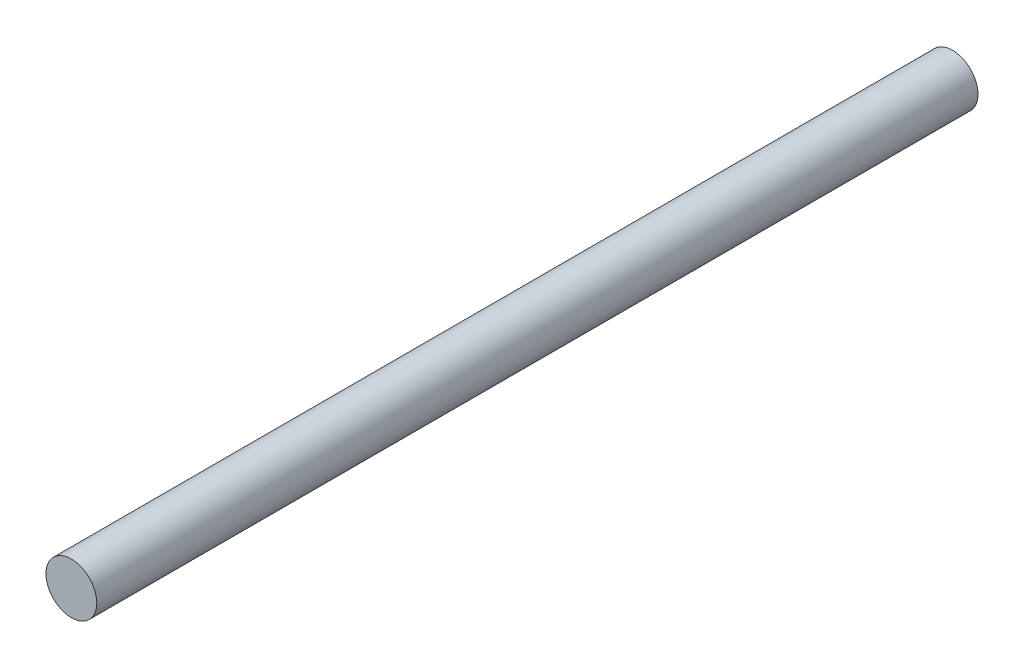
ISO-10303-21;
HEADER;
FILE_DESCRIPTION(('STEP AP214'),'2;1');
FILE_NAME('part.step','',(''),(''),'','','');
FILE_SCHEMA(('AUTOMOTIVE_DESIGN { 1 0 10303 214 1 1 1 1 }'));
ENDSEC;
DATA;
#1=APPLICATION_CONTEXT('core data for automotive mechanical design processes');
#2=APPLICATION_PROTOCOL_DEFINITION('international standard','automotive_design',2000,#1);
#3=PRODUCT_CONTEXT('',#1,'mechanical');
#4=PRODUCT('Part','Part','',(#3));
#5=PRODUCT_RELATED_PRODUCT_CATEGORY('part','',(#4));
#6=PRODUCT_DEFINITION_FORMATION('','',#4);
#7=PRODUCT_DEFINITION_CONTEXT('part definition',#1,'design');
#8=PRODUCT_DEFINITION('design','',#6,#7);
#9=PRODUCT_DEFINITION_SHAPE('','',#8);
#10=(LENGTH_UNIT() NAMED_UNIT(*) SI_UNIT(.MILLI.,.METRE.));
#11=(NAMED_UNIT(*) PLANE_ANGLE_UNIT() SI_UNIT($,.RADIAN.));
#12=(NAMED_UNIT(*) SI_UNIT($,.STERADIAN.) SOLID_ANGLE_UNIT());
#13=UNCERTAINTY_MEASURE_WITH_UNIT(LENGTH_MEASURE(1.E-05),#10,'distance_accuracy_value','');
#14=(GEOMETRIC_REPRESENTATION_CONTEXT(3) GLOBAL_UNCERTAINTY_ASSIGNED_CONTEXT((#13)) GLOBAL_UNIT_ASSIGNED_CONTEXT((#10,
#11,#12)) REPRESENTATION_CONTEXT('',''));
#15=CARTESIAN_POINT('',(0.,0.,0.));
#16=DIRECTION('',(0.,0.,1.));
#17=DIRECTION('',(1.,0.,0.));
#18=AXIS2_PLACEMENT_3D('',#15,#16,#17);
#19=CARTESIAN_POINT('',(0.,0.,330.2));
#20=DIRECTION('',(0.,0.,-1.));
#21=DIRECTION('',(-1.,0.,0.));
#22=AXIS2_PLACEMENT_3D('',#19,#20,#21);
#23=CYLINDRICAL_SURFACE('',#22,19.05);
#24=CARTESIAN_POINT('',(0.,0.,330.2));
#25=DIRECTION('',(0.,0.,1.));
#26=DIRECTION('',(1.,0.,0.));
#27=AXIS2_PLACEMENT_3D('',#24,#25,#26);
#28=CIRCLE('',#27,19.05);
#29=CARTESIAN_POINT('',(19.05,0.,330.2));
#30=VERTEX_POINT('',#29);
#31=EDGE_CURVE('E10',#30,#30,#28,.T.);
#32=ORIENTED_EDGE('',*,*,#31,.F.);
#33=EDGE_LOOP('',(#32));
#34=FACE_BOUND('',#33,.T.);
#35=CARTESIAN_POINT('',(0.,0.,-330.2));
#36=DIRECTION('',(0.,0.,1.));
#37=DIRECTION('',(1.,0.,0.));
#38=AXIS2_PLACEMENT_3D('',#35,#36,#37);
#39=CIRCLE('',#38,19.05);
#40=CARTESIAN_POINT('',(19.05,0.,-330.2));
#41=VERTEX_POINT('',#40);
#42=EDGE_CURVE('E40',#41,#41,#39,.T.);
#43=ORIENTED_EDGE('',*,*,#42,.T.);
#44=EDGE_LOOP('',(#43));
#45=FACE_BOUND('',#44,.T.);
#46=ADVANCED_FACE('F37',(#34,#45),#23,.T.);
#47=CARTESIAN_POINT('',(0.,0.,330.2));
#48=DIRECTION('',(0.,0.,1.));
#49=DIRECTION('',(1.,0.,0.));
#50=AXIS2_PLACEMENT_3D('',#47,#48,#49);
#51=PLANE('',#50);
#52=ORIENTED_EDGE('',*,*,#31,.T.);
#53=EDGE_LOOP('',(#52));
#54=FACE_BOUND('',#53,.T.);
#55=ADVANCED_FACE('F54',(#54),#51,.T.);
#56=CARTESIAN_POINT('',(0.,0.,-330.2));
#57=DIRECTION('',(0.,0.,1.));
#58=DIRECTION('',(1.,0.,0.));
#59=AXIS2_PLACEMENT_3D('',#56,#57,#58);
#60=PLANE('',#59);
#61=ORIENTED_EDGE('',*,*,#42,.F.);
#62=EDGE_LOOP('',(#61));
#63=FACE_BOUND('',#62,.T.);
#64=ADVANCED_FACE('F52',(#63),#60,.F.);
#65=CLOSED_SHELL('',(#46,#55,#64));
#66=MANIFOLD_SOLID_BREP('B2',#65);
#67=ADVANCED_BREP_SHAPE_REPRESENTATION('',(#18,#66),#14);
#68=SHAPE_DEFINITION_REPRESENTATION(#9,#67);
ENDSEC;
END-ISO-10303-21;
